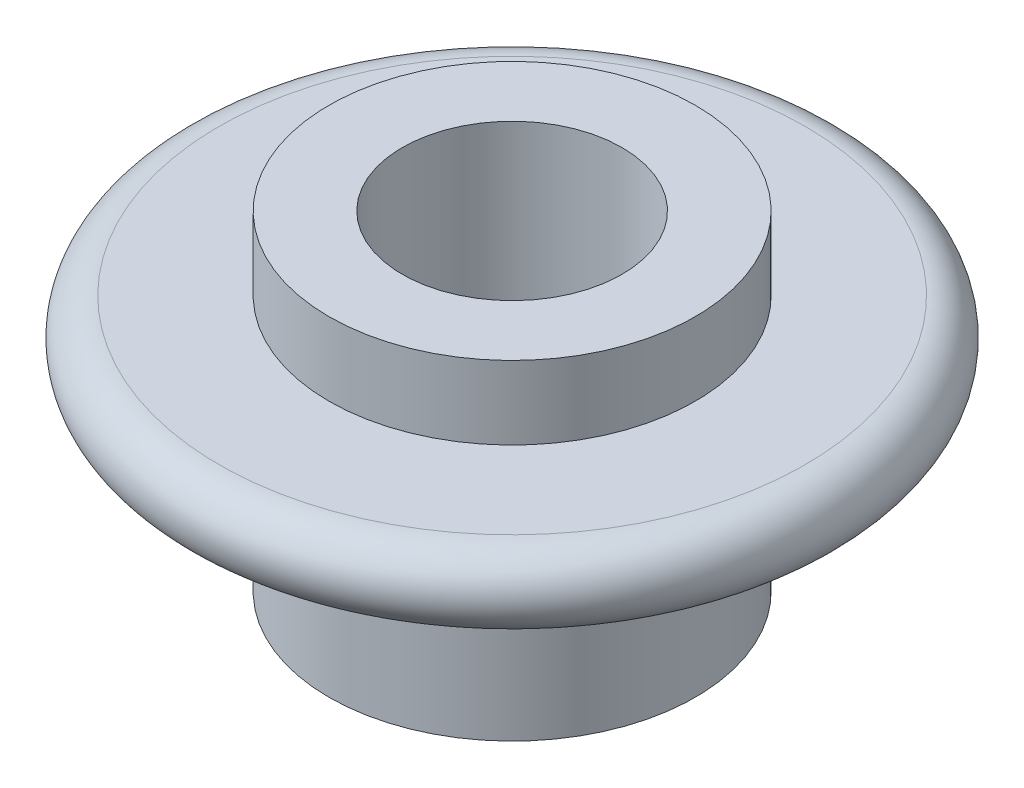
ISO-10303-21;
HEADER;
FILE_DESCRIPTION(('STEP AP214'),'2;1');
FILE_NAME('part.step','',(''),(''),'','','');
FILE_SCHEMA(('AUTOMOTIVE_DESIGN { 1 0 10303 214 1 1 1 1 }'));
ENDSEC;
DATA;
#1=APPLICATION_CONTEXT('core data for automotive mechanical design processes');
#2=APPLICATION_PROTOCOL_DEFINITION('international standard','automotive_design',2000,#1);
#3=PRODUCT_CONTEXT('',#1,'mechanical');
#4=PRODUCT('Part','Part','',(#3));
#5=PRODUCT_RELATED_PRODUCT_CATEGORY('part','',(#4));
#6=PRODUCT_DEFINITION_FORMATION('','',#4);
#7=PRODUCT_DEFINITION_CONTEXT('part definition',#1,'design');
#8=PRODUCT_DEFINITION('design','',#6,#7);
#9=PRODUCT_DEFINITION_SHAPE('','',#8);
#10=(LENGTH_UNIT() NAMED_UNIT(*) SI_UNIT(.MILLI.,.METRE.));
#11=(NAMED_UNIT(*) PLANE_ANGLE_UNIT() SI_UNIT($,.RADIAN.));
#12=(NAMED_UNIT(*) SI_UNIT($,.STERADIAN.) SOLID_ANGLE_UNIT());
#13=UNCERTAINTY_MEASURE_WITH_UNIT(LENGTH_MEASURE(1.E-05),#10,'distance_accuracy_value','');
#14=(GEOMETRIC_REPRESENTATION_CONTEXT(3) GLOBAL_UNCERTAINTY_ASSIGNED_CONTEXT((#13)) GLOBAL_UNIT_ASSIGNED_CONTEXT((#10,
#11,#12)) REPRESENTATION_CONTEXT('',''));
#15=CARTESIAN_POINT('',(0.,0.,0.));
#16=DIRECTION('',(0.,0.,1.));
#17=DIRECTION('',(1.,0.,0.));
#18=AXIS2_PLACEMENT_3D('',#15,#16,#17);
#19=CARTESIAN_POINT('',(0.,36.9458457580623,0.));
#20=DIRECTION('',(0.,-1.,0.));
#21=DIRECTION('',(0.,0.,-1.));
#22=AXIS2_PLACEMENT_3D('',#19,#20,#21);
#23=TOROIDAL_SURFACE('',#22,40.,5.);
#24=CARTESIAN_POINT('',(0.,41.9458457580623,0.));
#25=DIRECTION('',(0.,-1.,0.));
#26=DIRECTION('',(0.,0.,-1.));
#27=AXIS2_PLACEMENT_3D('',#24,#25,#26);
#28=CIRCLE('',#27,40.);
#29=CARTESIAN_POINT('',(0.,41.9458457580623,-40.));
#30=VERTEX_POINT('',#29);
#31=EDGE_CURVE('E40',#30,#30,#28,.F.);
#32=ORIENTED_EDGE('',*,*,#31,.F.);
#33=EDGE_LOOP('',(#32));
#34=FACE_BOUND('',#33,.T.);
#35=CARTESIAN_POINT('',(0.,31.9458457580623,0.));
#36=DIRECTION('',(0.,1.,0.));
#37=DIRECTION('',(0.,0.,1.));
#38=AXIS2_PLACEMENT_3D('',#35,#36,#37);
#39=CIRCLE('',#38,40.);
#40=CARTESIAN_POINT('',(0.,31.9458457580623,40.));
#41=VERTEX_POINT('',#40);
#42=EDGE_CURVE('E10',#41,#41,#39,.F.);
#43=ORIENTED_EDGE('',*,*,#42,.F.);
#44=EDGE_LOOP('',(#43));
#45=FACE_BOUND('',#44,.T.);
#46=ADVANCED_FACE('F33',(#34,#45),#23,.T.);
#47=CARTESIAN_POINT('',(0.,-76.3209778914986,0.));
#48=DIRECTION('',(0.,-1.,0.));
#49=DIRECTION('',(0.,0.,-1.));
#50=AXIS2_PLACEMENT_3D('',#47,#48,#49);
#51=CYLINDRICAL_SURFACE('',#50,15.);
#52=CARTESIAN_POINT('',(0.,6.94584575806224,0.));
#53=DIRECTION('',(0.,-1.,0.));
#54=DIRECTION('',(0.,0.,-1.));
#55=AXIS2_PLACEMENT_3D('',#52,#53,#54);
#56=CIRCLE('',#55,15.);
#57=CARTESIAN_POINT('',(0.,6.94584575806224,-15.));
#58=VERTEX_POINT('',#57);
#59=EDGE_CURVE('E44',#58,#58,#56,.T.);
#60=ORIENTED_EDGE('',*,*,#59,.T.);
#61=EDGE_LOOP('',(#60));
#62=FACE_BOUND('',#61,.T.);
#63=CARTESIAN_POINT('',(0.,51.9458457580623,0.));
#64=DIRECTION('',(0.,-1.,0.));
#65=DIRECTION('',(0.,0.,-1.));
#66=AXIS2_PLACEMENT_3D('',#63,#64,#65);
#67=CIRCLE('',#66,15.);
#68=CARTESIAN_POINT('',(0.,51.9458457580623,-15.));
#69=VERTEX_POINT('',#68);
#70=EDGE_CURVE('E62',#69,#69,#67,.T.);
#71=ORIENTED_EDGE('',*,*,#70,.F.);
#72=EDGE_LOOP('',(#71));
#73=FACE_BOUND('',#72,.T.);
#74=ADVANCED_FACE('F68',(#62,#73),#51,.F.);
#75=CARTESIAN_POINT('',(25.,6.94584575806225,0.));
#76=DIRECTION('',(0.,1.,0.));
#77=DIRECTION('',(0.,0.,1.));
#78=AXIS2_PLACEMENT_3D('',#75,#76,#77);
#79=PLANE('',#78);
#80=ORIENTED_EDGE('',*,*,#59,.F.);
#81=EDGE_LOOP('',(#80));
#82=FACE_BOUND('',#81,.T.);
#83=CARTESIAN_POINT('',(0.,6.94584575806226,0.));
#84=DIRECTION('',(0.,-1.,0.));
#85=DIRECTION('',(0.,0.,-1.));
#86=AXIS2_PLACEMENT_3D('',#83,#84,#85);
#87=CIRCLE('',#86,25.);
#88=CARTESIAN_POINT('',(0.,6.94584575806226,-25.));
#89=VERTEX_POINT('',#88);
#90=EDGE_CURVE('E48',#89,#89,#87,.T.);
#91=ORIENTED_EDGE('',*,*,#90,.T.);
#92=EDGE_LOOP('',(#91));
#93=FACE_BOUND('',#92,.T.);
#94=ADVANCED_FACE('F70',(#82,#93),#79,.F.);
#95=CARTESIAN_POINT('',(0.,-76.3209778914986,0.));
#96=DIRECTION('',(0.,-1.,0.));
#97=DIRECTION('',(0.,0.,-1.));
#98=AXIS2_PLACEMENT_3D('',#95,#96,#97);
#99=CYLINDRICAL_SURFACE('',#98,25.);
#100=ORIENTED_EDGE('',*,*,#90,.F.);
#101=EDGE_LOOP('',(#100));
#102=FACE_BOUND('',#101,.T.);
#103=CARTESIAN_POINT('',(0.,31.9458457580623,0.));
#104=DIRECTION('',(0.,-1.,0.));
#105=DIRECTION('',(0.,0.,-1.));
#106=AXIS2_PLACEMENT_3D('',#103,#104,#105);
#107=CIRCLE('',#106,25.);
#108=CARTESIAN_POINT('',(0.,31.9458457580623,-25.));
#109=VERTEX_POINT('',#108);
#110=EDGE_CURVE('E53',#109,#109,#107,.T.);
#111=ORIENTED_EDGE('',*,*,#110,.T.);
#112=EDGE_LOOP('',(#111));
#113=FACE_BOUND('',#112,.T.);
#114=ADVANCED_FACE('F76',(#102,#113),#99,.T.);
#115=CARTESIAN_POINT('',(45.,31.9458457580623,0.));
#116=DIRECTION('',(0.,1.,0.));
#117=DIRECTION('',(0.,0.,1.));
#118=AXIS2_PLACEMENT_3D('',#115,#116,#117);
#119=PLANE('',#118);
#120=ORIENTED_EDGE('',*,*,#42,.T.);
#121=EDGE_LOOP('',(#120));
#122=FACE_BOUND('',#121,.T.);
#123=ORIENTED_EDGE('',*,*,#110,.F.);
#124=EDGE_LOOP('',(#123));
#125=FACE_BOUND('',#124,.T.);
#126=ADVANCED_FACE('F83',(#122,#125),#119,.F.);
#127=CARTESIAN_POINT('',(25.,41.9458457580623,0.));
#128=DIRECTION('',(0.,-1.,0.));
#129=DIRECTION('',(0.,0.,-1.));
#130=AXIS2_PLACEMENT_3D('',#127,#128,#129);
#131=PLANE('',#130);
#132=ORIENTED_EDGE('',*,*,#31,.T.);
#133=EDGE_LOOP('',(#132));
#134=FACE_BOUND('',#133,.T.);
#135=CARTESIAN_POINT('',(0.,41.9458457580623,0.));
#136=DIRECTION('',(0.,-1.,0.));
#137=DIRECTION('',(0.,0.,-1.));
#138=AXIS2_PLACEMENT_3D('',#135,#136,#137);
#139=CIRCLE('',#138,25.);
#140=CARTESIAN_POINT('',(0.,41.9458457580623,-25.));
#141=VERTEX_POINT('',#140);
#142=EDGE_CURVE('E56',#141,#141,#139,.T.);
#143=ORIENTED_EDGE('',*,*,#142,.T.);
#144=EDGE_LOOP('',(#143));
#145=FACE_BOUND('',#144,.T.);
#146=ADVANCED_FACE('F87',(#134,#145),#131,.F.);
#147=CARTESIAN_POINT('',(0.,-76.3209778914986,0.));
#148=DIRECTION('',(0.,-1.,0.));
#149=DIRECTION('',(0.,0.,-1.));
#150=AXIS2_PLACEMENT_3D('',#147,#148,#149);
#151=CYLINDRICAL_SURFACE('',#150,25.);
#152=ORIENTED_EDGE('',*,*,#142,.F.);
#153=EDGE_LOOP('',(#152));
#154=FACE_BOUND('',#153,.T.);
#155=CARTESIAN_POINT('',(0.,51.9458457580623,0.));
#156=DIRECTION('',(0.,-1.,0.));
#157=DIRECTION('',(0.,0.,-1.));
#158=AXIS2_PLACEMENT_3D('',#155,#156,#157);
#159=CIRCLE('',#158,25.);
#160=CARTESIAN_POINT('',(0.,51.9458457580623,-25.));
#161=VERTEX_POINT('',#160);
#162=EDGE_CURVE('E59',#161,#161,#159,.T.);
#163=ORIENTED_EDGE('',*,*,#162,.T.);
#164=EDGE_LOOP('',(#163));
#165=FACE_BOUND('',#164,.T.);
#166=ADVANCED_FACE('F90',(#154,#165),#151,.T.);
#167=CARTESIAN_POINT('',(15.,51.9458457580623,0.));
#168=DIRECTION('',(0.,-1.,0.));
#169=DIRECTION('',(0.,0.,-1.));
#170=AXIS2_PLACEMENT_3D('',#167,#168,#169);
#171=PLANE('',#170);
#172=ORIENTED_EDGE('',*,*,#162,.F.);
#173=EDGE_LOOP('',(#172));
#174=FACE_BOUND('',#173,.T.);
#175=ORIENTED_EDGE('',*,*,#70,.T.);
#176=EDGE_LOOP('',(#175));
#177=FACE_BOUND('',#176,.T.);
#178=ADVANCED_FACE('F66',(#174,#177),#171,.F.);
#179=CLOSED_SHELL('',(#46,#74,#94,#114,#126,#146,#166,#178));
#180=MANIFOLD_SOLID_BREP('B2',#179);
#181=ADVANCED_BREP_SHAPE_REPRESENTATION('',(#18,#180),#14);
#182=SHAPE_DEFINITION_REPRESENTATION(#9,#181);
ENDSEC;
END-ISO-10303-21;
